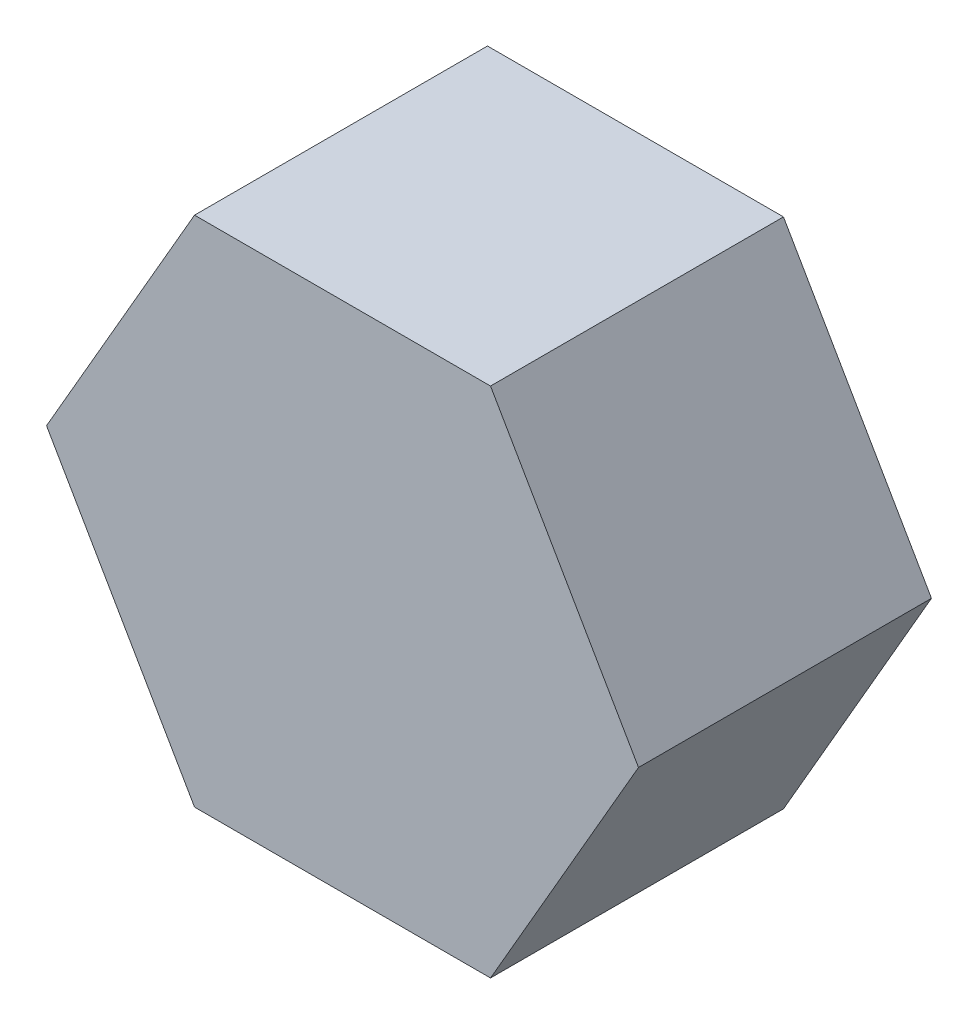
ISO-10303-21;
HEADER;
FILE_DESCRIPTION(('STEP AP214'),'2;1');
FILE_NAME('part.step','',(''),(''),'','','');
FILE_SCHEMA(('AUTOMOTIVE_DESIGN { 1 0 10303 214 1 1 1 1 }'));
ENDSEC;
DATA;
#1=APPLICATION_CONTEXT('core data for automotive mechanical design processes');
#2=APPLICATION_PROTOCOL_DEFINITION('international standard','automotive_design',2000,#1);
#3=PRODUCT_CONTEXT('',#1,'mechanical');
#4=PRODUCT('Part','Part','',(#3));
#5=PRODUCT_RELATED_PRODUCT_CATEGORY('part','',(#4));
#6=PRODUCT_DEFINITION_FORMATION('','',#4);
#7=PRODUCT_DEFINITION_CONTEXT('part definition',#1,'design');
#8=PRODUCT_DEFINITION('design','',#6,#7);
#9=PRODUCT_DEFINITION_SHAPE('','',#8);
#10=(LENGTH_UNIT() NAMED_UNIT(*) SI_UNIT(.MILLI.,.METRE.));
#11=(NAMED_UNIT(*) PLANE_ANGLE_UNIT() SI_UNIT($,.RADIAN.));
#12=(NAMED_UNIT(*) SI_UNIT($,.STERADIAN.) SOLID_ANGLE_UNIT());
#13=UNCERTAINTY_MEASURE_WITH_UNIT(LENGTH_MEASURE(1.E-05),#10,'distance_accuracy_value','');
#14=(GEOMETRIC_REPRESENTATION_CONTEXT(3) GLOBAL_UNCERTAINTY_ASSIGNED_CONTEXT((#13)) GLOBAL_UNIT_ASSIGNED_CONTEXT((#10,
#11,#12)) REPRESENTATION_CONTEXT('',''));
#15=CARTESIAN_POINT('',(0.,0.,0.));
#16=DIRECTION('',(0.,0.,1.));
#17=DIRECTION('',(1.,0.,0.));
#18=AXIS2_PLACEMENT_3D('',#15,#16,#17);
#19=CARTESIAN_POINT('',(-4.04145188432738,7.,8.));
#20=DIRECTION('',(0.866025403784439,-0.5,0.));
#21=DIRECTION('',(0.5,0.866025403784439,0.));
#22=AXIS2_PLACEMENT_3D('',#19,#20,#21);
#23=PLANE('',#22);
#24=DIRECTION('',(-0.5,-0.866025403784438,0.));
#25=VECTOR('',#24,1.);
#26=CARTESIAN_POINT('',(-4.04145188432738,7.,0.));
#27=LINE('',#26,#25);
#28=CARTESIAN_POINT('',(-4.04145188432738,7.,0.));
#29=VERTEX_POINT('',#28);
#30=CARTESIAN_POINT('',(-8.08290376865476,0.,0.));
#31=VERTEX_POINT('',#30);
#32=EDGE_CURVE('E117',#29,#31,#27,.T.);
#33=ORIENTED_EDGE('',*,*,#32,.T.);
#34=DIRECTION('',(0.,0.,-1.));
#35=VECTOR('',#34,1.);
#36=CARTESIAN_POINT('',(-8.08290376865476,0.,8.));
#37=LINE('',#36,#35);
#38=CARTESIAN_POINT('',(-8.08290376865476,0.,8.));
#39=VERTEX_POINT('',#38);
#40=EDGE_CURVE('E11',#39,#31,#37,.T.);
#41=ORIENTED_EDGE('',*,*,#40,.F.);
#42=DIRECTION('',(-0.5,-0.866025403784438,0.));
#43=VECTOR('',#42,1.);
#44=CARTESIAN_POINT('',(-4.04145188432738,7.,8.));
#45=LINE('',#44,#43);
#46=CARTESIAN_POINT('',(-4.04145188432738,7.,8.));
#47=VERTEX_POINT('',#46);
#48=EDGE_CURVE('E127',#47,#39,#45,.T.);
#49=ORIENTED_EDGE('',*,*,#48,.F.);
#50=DIRECTION('',(0.,0.,-1.));
#51=VECTOR('',#50,1.);
#52=CARTESIAN_POINT('',(-4.04145188432738,7.,8.));
#53=LINE('',#52,#51);
#54=EDGE_CURVE('E113',#47,#29,#53,.T.);
#55=ORIENTED_EDGE('',*,*,#54,.T.);
#56=EDGE_LOOP('',(#33,#41,#49,#55));
#57=FACE_BOUND('',#56,.T.);
#58=ADVANCED_FACE('F33',(#57),#23,.F.);
#59=CARTESIAN_POINT('',(-8.08290376865476,0.,8.));
#60=DIRECTION('',(0.866025403784439,0.5,0.));
#61=DIRECTION('',(-0.5,0.866025403784439,0.));
#62=AXIS2_PLACEMENT_3D('',#59,#60,#61);
#63=PLANE('',#62);
#64=DIRECTION('',(0.5,-0.866025403784439,0.));
#65=VECTOR('',#64,1.);
#66=CARTESIAN_POINT('',(-8.08290376865476,0.,0.));
#67=LINE('',#66,#65);
#68=CARTESIAN_POINT('',(-4.04145188432738,-7.,0.));
#69=VERTEX_POINT('',#68);
#70=EDGE_CURVE('E120',#31,#69,#67,.T.);
#71=ORIENTED_EDGE('',*,*,#70,.T.);
#72=DIRECTION('',(0.,0.,-1.));
#73=VECTOR('',#72,1.);
#74=CARTESIAN_POINT('',(-4.04145188432738,-7.,8.));
#75=LINE('',#74,#73);
#76=CARTESIAN_POINT('',(-4.04145188432738,-7.,8.));
#77=VERTEX_POINT('',#76);
#78=EDGE_CURVE('E41',#77,#69,#75,.T.);
#79=ORIENTED_EDGE('',*,*,#78,.F.);
#80=DIRECTION('',(0.5,-0.866025403784439,0.));
#81=VECTOR('',#80,1.);
#82=CARTESIAN_POINT('',(-8.08290376865476,0.,8.));
#83=LINE('',#82,#81);
#84=EDGE_CURVE('E86',#39,#77,#83,.T.);
#85=ORIENTED_EDGE('',*,*,#84,.F.);
#86=ORIENTED_EDGE('',*,*,#40,.T.);
#87=EDGE_LOOP('',(#71,#79,#85,#86));
#88=FACE_BOUND('',#87,.T.);
#89=ADVANCED_FACE('F151',(#88),#63,.F.);
#90=CARTESIAN_POINT('',(-4.04145188432738,-7.,8.));
#91=DIRECTION('',(0.,1.,0.));
#92=DIRECTION('',(0.,0.,1.));
#93=AXIS2_PLACEMENT_3D('',#90,#91,#92);
#94=PLANE('',#93);
#95=DIRECTION('',(1.,0.,0.));
#96=VECTOR('',#95,1.);
#97=CARTESIAN_POINT('',(-4.04145188432738,-7.,0.));
#98=LINE('',#97,#96);
#99=CARTESIAN_POINT('',(4.04145188432738,-7.,0.));
#100=VERTEX_POINT('',#99);
#101=EDGE_CURVE('E122',#69,#100,#98,.T.);
#102=ORIENTED_EDGE('',*,*,#101,.T.);
#103=DIRECTION('',(0.,0.,-1.));
#104=VECTOR('',#103,1.);
#105=CARTESIAN_POINT('',(4.04145188432738,-7.,8.));
#106=LINE('',#105,#104);
#107=CARTESIAN_POINT('',(4.04145188432738,-7.,8.));
#108=VERTEX_POINT('',#107);
#109=EDGE_CURVE('E108',#108,#100,#106,.T.);
#110=ORIENTED_EDGE('',*,*,#109,.F.);
#111=DIRECTION('',(1.,0.,0.));
#112=VECTOR('',#111,1.);
#113=CARTESIAN_POINT('',(-4.04145188432738,-7.,8.));
#114=LINE('',#113,#112);
#115=EDGE_CURVE('E99',#77,#108,#114,.T.);
#116=ORIENTED_EDGE('',*,*,#115,.F.);
#117=ORIENTED_EDGE('',*,*,#78,.T.);
#118=EDGE_LOOP('',(#102,#110,#116,#117));
#119=FACE_BOUND('',#118,.T.);
#120=ADVANCED_FACE('F133',(#119),#94,.F.);
#121=CARTESIAN_POINT('',(4.04145188432738,-7.,8.));
#122=DIRECTION('',(-0.866025403784439,0.5,0.));
#123=DIRECTION('',(-0.5,-0.866025403784439,0.));
#124=AXIS2_PLACEMENT_3D('',#121,#122,#123);
#125=PLANE('',#124);
#126=DIRECTION('',(0.5,0.866025403784439,0.));
#127=VECTOR('',#126,1.);
#128=CARTESIAN_POINT('',(4.04145188432738,-7.,0.));
#129=LINE('',#128,#127);
#130=CARTESIAN_POINT('',(8.08290376865476,0.,0.));
#131=VERTEX_POINT('',#130);
#132=EDGE_CURVE('E107',#100,#131,#129,.T.);
#133=ORIENTED_EDGE('',*,*,#132,.T.);
#134=DIRECTION('',(0.,0.,-1.));
#135=VECTOR('',#134,1.);
#136=CARTESIAN_POINT('',(8.08290376865476,0.,8.));
#137=LINE('',#136,#135);
#138=CARTESIAN_POINT('',(8.08290376865476,0.,8.));
#139=VERTEX_POINT('',#138);
#140=EDGE_CURVE('E104',#139,#131,#137,.T.);
#141=ORIENTED_EDGE('',*,*,#140,.F.);
#142=DIRECTION('',(0.5,0.866025403784439,0.));
#143=VECTOR('',#142,1.);
#144=CARTESIAN_POINT('',(4.04145188432738,-7.,8.));
#145=LINE('',#144,#143);
#146=EDGE_CURVE('E93',#108,#139,#145,.T.);
#147=ORIENTED_EDGE('',*,*,#146,.F.);
#148=ORIENTED_EDGE('',*,*,#109,.T.);
#149=EDGE_LOOP('',(#133,#141,#147,#148));
#150=FACE_BOUND('',#149,.T.);
#151=ADVANCED_FACE('F105',(#150),#125,.F.);
#152=CARTESIAN_POINT('',(8.08290376865476,0.,8.));
#153=DIRECTION('',(-0.866025403784439,-0.5,0.));
#154=DIRECTION('',(0.5,-0.866025403784439,0.));
#155=AXIS2_PLACEMENT_3D('',#152,#153,#154);
#156=PLANE('',#155);
#157=DIRECTION('',(-0.5,0.866025403784439,0.));
#158=VECTOR('',#157,1.);
#159=CARTESIAN_POINT('',(8.08290376865476,0.,0.));
#160=LINE('',#159,#158);
#161=CARTESIAN_POINT('',(4.04145188432739,7.,0.));
#162=VERTEX_POINT('',#161);
#163=EDGE_CURVE('E72',#131,#162,#160,.T.);
#164=ORIENTED_EDGE('',*,*,#163,.T.);
#165=DIRECTION('',(0.,0.,-1.));
#166=VECTOR('',#165,1.);
#167=CARTESIAN_POINT('',(4.04145188432739,7.,8.));
#168=LINE('',#167,#166);
#169=CARTESIAN_POINT('',(4.04145188432739,7.,8.));
#170=VERTEX_POINT('',#169);
#171=EDGE_CURVE('E109',#170,#162,#168,.T.);
#172=ORIENTED_EDGE('',*,*,#171,.F.);
#173=DIRECTION('',(-0.5,0.866025403784439,0.));
#174=VECTOR('',#173,1.);
#175=CARTESIAN_POINT('',(8.08290376865476,0.,8.));
#176=LINE('',#175,#174);
#177=EDGE_CURVE('E97',#139,#170,#176,.T.);
#178=ORIENTED_EDGE('',*,*,#177,.F.);
#179=ORIENTED_EDGE('',*,*,#140,.T.);
#180=EDGE_LOOP('',(#164,#172,#178,#179));
#181=FACE_BOUND('',#180,.T.);
#182=ADVANCED_FACE('F111',(#181),#156,.F.);
#183=CARTESIAN_POINT('',(4.04145188432739,7.,8.));
#184=DIRECTION('',(0.,-1.,0.));
#185=DIRECTION('',(0.,0.,-1.));
#186=AXIS2_PLACEMENT_3D('',#183,#184,#185);
#187=PLANE('',#186);
#188=DIRECTION('',(-1.,0.,0.));
#189=VECTOR('',#188,1.);
#190=CARTESIAN_POINT('',(4.04145188432739,7.,0.));
#191=LINE('',#190,#189);
#192=EDGE_CURVE('E78',#162,#29,#191,.T.);
#193=ORIENTED_EDGE('',*,*,#192,.T.);
#194=ORIENTED_EDGE('',*,*,#54,.F.);
#195=DIRECTION('',(-1.,0.,0.));
#196=VECTOR('',#195,1.);
#197=CARTESIAN_POINT('',(4.04145188432739,7.,8.));
#198=LINE('',#197,#196);
#199=EDGE_CURVE('E49',#170,#47,#198,.T.);
#200=ORIENTED_EDGE('',*,*,#199,.F.);
#201=ORIENTED_EDGE('',*,*,#171,.T.);
#202=EDGE_LOOP('',(#193,#194,#200,#201));
#203=FACE_BOUND('',#202,.T.);
#204=ADVANCED_FACE('F140',(#203),#187,.F.);
#205=CARTESIAN_POINT('',(0.,0.,8.));
#206=DIRECTION('',(0.,0.,1.));
#207=DIRECTION('',(1.,0.,0.));
#208=AXIS2_PLACEMENT_3D('',#205,#206,#207);
#209=PLANE('',#208);
#210=ORIENTED_EDGE('',*,*,#48,.T.);
#211=ORIENTED_EDGE('',*,*,#84,.T.);
#212=ORIENTED_EDGE('',*,*,#115,.T.);
#213=ORIENTED_EDGE('',*,*,#146,.T.);
#214=ORIENTED_EDGE('',*,*,#177,.T.);
#215=ORIENTED_EDGE('',*,*,#199,.T.);
#216=EDGE_LOOP('',(#210,#211,#212,#213,#214,#215));
#217=FACE_BOUND('',#216,.T.);
#218=ADVANCED_FACE('F95',(#217),#209,.T.);
#219=CARTESIAN_POINT('',(0.,0.,0.));
#220=DIRECTION('',(0.,0.,1.));
#221=DIRECTION('',(1.,0.,0.));
#222=AXIS2_PLACEMENT_3D('',#219,#220,#221);
#223=PLANE('',#222);
#224=ORIENTED_EDGE('',*,*,#32,.F.);
#225=ORIENTED_EDGE('',*,*,#192,.F.);
#226=ORIENTED_EDGE('',*,*,#163,.F.);
#227=ORIENTED_EDGE('',*,*,#132,.F.);
#228=ORIENTED_EDGE('',*,*,#101,.F.);
#229=ORIENTED_EDGE('',*,*,#70,.F.);
#230=EDGE_LOOP('',(#224,#225,#226,#227,#228,#229));
#231=FACE_BOUND('',#230,.T.);
#232=ADVANCED_FACE('F136',(#231),#223,.F.);
#233=CLOSED_SHELL('',(#58,#89,#120,#151,#182,#204,#218,#232));
#234=MANIFOLD_SOLID_BREP('B2',#233);
#235=ADVANCED_BREP_SHAPE_REPRESENTATION('',(#18,#234),#14);
#236=SHAPE_DEFINITION_REPRESENTATION(#9,#235);
ENDSEC;
END-ISO-10303-21;
